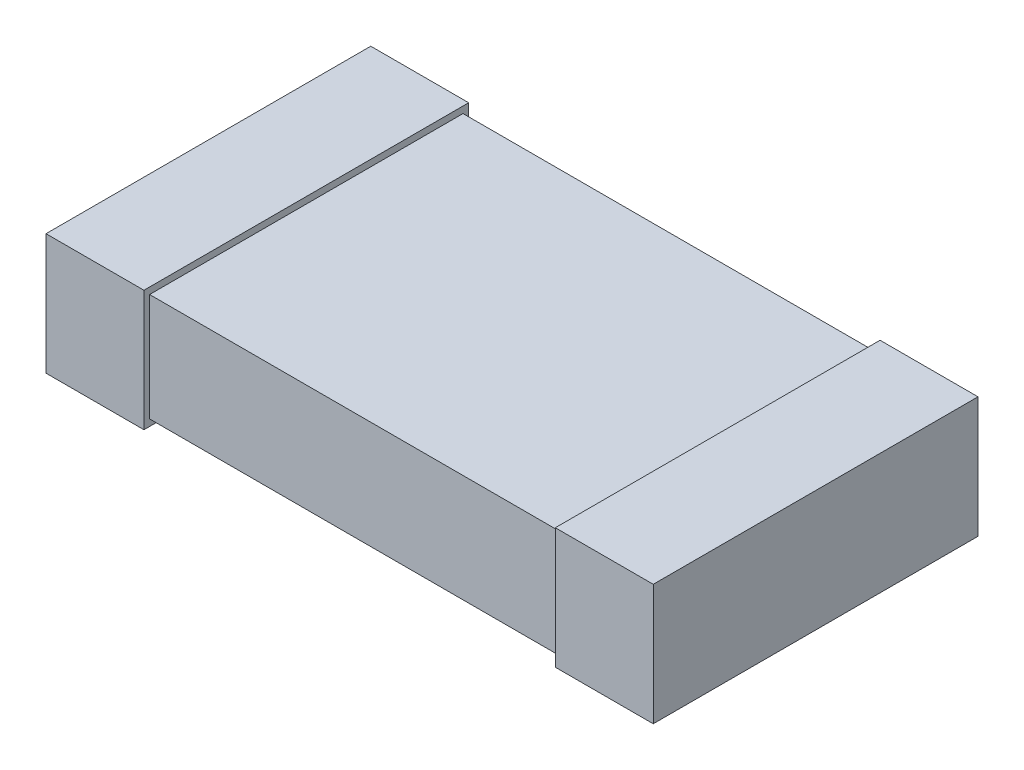
ISO-10303-21;
HEADER;
FILE_DESCRIPTION(('STEP AP214'),'2;1');
FILE_NAME('part.step','',(''),(''),'','','');
FILE_SCHEMA(('AUTOMOTIVE_DESIGN { 1 0 10303 214 1 1 1 1 }'));
ENDSEC;
DATA;
#1=APPLICATION_CONTEXT('core data for automotive mechanical design processes');
#2=APPLICATION_PROTOCOL_DEFINITION('international standard','automotive_design',2000,#1);
#3=PRODUCT_CONTEXT('',#1,'mechanical');
#4=PRODUCT('Part','Part','',(#3));
#5=PRODUCT_RELATED_PRODUCT_CATEGORY('part','',(#4));
#6=PRODUCT_DEFINITION_FORMATION('','',#4);
#7=PRODUCT_DEFINITION_CONTEXT('part definition',#1,'design');
#8=PRODUCT_DEFINITION('design','',#6,#7);
#9=PRODUCT_DEFINITION_SHAPE('','',#8);
#10=(LENGTH_UNIT() NAMED_UNIT(*) SI_UNIT(.MILLI.,.METRE.));
#11=(NAMED_UNIT(*) PLANE_ANGLE_UNIT() SI_UNIT($,.RADIAN.));
#12=(NAMED_UNIT(*) SI_UNIT($,.STERADIAN.) SOLID_ANGLE_UNIT());
#13=UNCERTAINTY_MEASURE_WITH_UNIT(LENGTH_MEASURE(1.E-05),#10,'distance_accuracy_value','');
#14=(GEOMETRIC_REPRESENTATION_CONTEXT(3) GLOBAL_UNCERTAINTY_ASSIGNED_CONTEXT((#13)) GLOBAL_UNIT_ASSIGNED_CONTEXT((#10,
#11,#12)) REPRESENTATION_CONTEXT('',''));
#15=CARTESIAN_POINT('',(0.,0.,0.));
#16=DIRECTION('',(0.,0.,1.));
#17=DIRECTION('',(1.,0.,0.));
#18=AXIS2_PLACEMENT_3D('',#15,#16,#17);
#19=CARTESIAN_POINT('',(-1.55,0.55,-0.8));
#20=DIRECTION('',(1.,0.,0.));
#21=DIRECTION('',(0.,0.,-1.));
#22=AXIS2_PLACEMENT_3D('',#19,#20,#21);
#23=PLANE('',#22);
#24=DIRECTION('',(0.,0.,-1.));
#25=VECTOR('',#24,1.);
#26=CARTESIAN_POINT('',(-1.55,-0.03341828975536,-0.828894255709));
#27=LINE('',#26,#25);
#28=CARTESIAN_POINT('',(-1.55,-0.03341828975536,0.828894255709));
#29=VERTEX_POINT('',#28);
#30=CARTESIAN_POINT('',(-1.55,-0.03341828975536,-0.828894255709));
#31=VERTEX_POINT('',#30);
#32=EDGE_CURVE('E108',#29,#31,#27,.T.);
#33=ORIENTED_EDGE('',*,*,#32,.F.);
#34=DIRECTION('',(0.,1.,0.));
#35=VECTOR('',#34,1.);
#36=CARTESIAN_POINT('',(-1.55,0.583418289755,0.828894255709));
#37=LINE('',#36,#35);
#38=CARTESIAN_POINT('',(-1.55,0.583418289755,0.828894255709));
#39=VERTEX_POINT('',#38);
#40=EDGE_CURVE('E105',#39,#29,#37,.F.);
#41=ORIENTED_EDGE('',*,*,#40,.F.);
#42=DIRECTION('',(0.,0.,1.));
#43=VECTOR('',#42,1.);
#44=CARTESIAN_POINT('',(-1.55,0.583418289755,-0.828894255709));
#45=LINE('',#44,#43);
#46=CARTESIAN_POINT('',(-1.55,0.583418289755,-0.828894255709));
#47=VERTEX_POINT('',#46);
#48=EDGE_CURVE('E121',#47,#39,#45,.T.);
#49=ORIENTED_EDGE('',*,*,#48,.F.);
#50=DIRECTION('',(0.,1.,0.));
#51=VECTOR('',#50,1.);
#52=CARTESIAN_POINT('',(-1.55,0.55,-0.828894255709));
#53=LINE('',#52,#51);
#54=EDGE_CURVE('E20',#31,#47,#53,.T.);
#55=ORIENTED_EDGE('',*,*,#54,.F.);
#56=EDGE_LOOP('',(#33,#41,#49,#55));
#57=FACE_BOUND('',#56,.T.);
#58=ADVANCED_FACE('F17',(#57),#23,.F.);
#59=CARTESIAN_POINT('',(1.55,0.55,-0.8));
#60=DIRECTION('',(-1.,0.,0.));
#61=DIRECTION('',(0.,0.,1.));
#62=AXIS2_PLACEMENT_3D('',#59,#60,#61);
#63=PLANE('',#62);
#64=DIRECTION('',(0.,0.,1.));
#65=VECTOR('',#64,1.);
#66=CARTESIAN_POINT('',(1.55,0.583418289755,0.828894255709));
#67=LINE('',#66,#65);
#68=CARTESIAN_POINT('',(1.55,0.583418289755,0.828894255709));
#69=VERTEX_POINT('',#68);
#70=CARTESIAN_POINT('',(1.55,0.583418289755,-0.828894255709));
#71=VERTEX_POINT('',#70);
#72=EDGE_CURVE('E151',#69,#71,#67,.F.);
#73=ORIENTED_EDGE('',*,*,#72,.F.);
#74=DIRECTION('',(0.,1.,0.));
#75=VECTOR('',#74,1.);
#76=CARTESIAN_POINT('',(1.55,0.583418289755,0.828894255709));
#77=LINE('',#76,#75);
#78=CARTESIAN_POINT('',(1.55,-0.03341828975536,0.828894255709));
#79=VERTEX_POINT('',#78);
#80=EDGE_CURVE('E154',#79,#69,#77,.T.);
#81=ORIENTED_EDGE('',*,*,#80,.F.);
#82=DIRECTION('',(0.,0.,-1.));
#83=VECTOR('',#82,1.);
#84=CARTESIAN_POINT('',(1.55,-0.03341828975536,0.828894255709));
#85=LINE('',#84,#83);
#86=CARTESIAN_POINT('',(1.55,-0.03341828975536,-0.828894255709));
#87=VERTEX_POINT('',#86);
#88=EDGE_CURVE('E160',#87,#79,#85,.F.);
#89=ORIENTED_EDGE('',*,*,#88,.F.);
#90=DIRECTION('',(0.,1.,0.));
#91=VECTOR('',#90,1.);
#92=CARTESIAN_POINT('',(1.55,0.55,-0.828894255709));
#93=LINE('',#92,#91);
#94=EDGE_CURVE('E112',#71,#87,#93,.F.);
#95=ORIENTED_EDGE('',*,*,#94,.F.);
#96=EDGE_LOOP('',(#73,#81,#89,#95));
#97=FACE_BOUND('',#96,.T.);
#98=ADVANCED_FACE('F265',(#97),#63,.F.);
#99=CARTESIAN_POINT('',(-1.05,-0.03341828975536,-0.828894255709));
#100=DIRECTION('',(0.,-1.,0.));
#101=DIRECTION('',(0.,0.,-1.));
#102=AXIS2_PLACEMENT_3D('',#99,#100,#101);
#103=PLANE('',#102);
#104=DIRECTION('',(0.,0.,1.));
#105=VECTOR('',#104,1.);
#106=CARTESIAN_POINT('',(-1.05,-0.03341828975536,0.));
#107=LINE('',#106,#105);
#108=CARTESIAN_POINT('',(-1.05,-0.03341828975536,-0.828894255709));
#109=VERTEX_POINT('',#108);
#110=CARTESIAN_POINT('',(-1.05,-0.03341828975536,0.828894255709));
#111=VERTEX_POINT('',#110);
#112=EDGE_CURVE('E118',#109,#111,#107,.T.);
#113=ORIENTED_EDGE('',*,*,#112,.T.);
#114=DIRECTION('',(1.,0.,0.));
#115=VECTOR('',#114,1.);
#116=CARTESIAN_POINT('',(-1.05,-0.03341828975536,0.828894255709));
#117=LINE('',#116,#115);
#118=EDGE_CURVE('E115',#29,#111,#117,.T.);
#119=ORIENTED_EDGE('',*,*,#118,.F.);
#120=ORIENTED_EDGE('',*,*,#32,.T.);
#121=DIRECTION('',(-1.,0.,0.));
#122=VECTOR('',#121,1.);
#123=CARTESIAN_POINT('',(-1.05,-0.03341828975536,-0.828894255709));
#124=LINE('',#123,#122);
#125=EDGE_CURVE('E140',#109,#31,#124,.T.);
#126=ORIENTED_EDGE('',*,*,#125,.F.);
#127=EDGE_LOOP('',(#113,#119,#120,#126));
#128=FACE_BOUND('',#127,.T.);
#129=ADVANCED_FACE('F116',(#128),#103,.T.);
#130=CARTESIAN_POINT('',(-1.05,0.583418289755,0.828894255709));
#131=DIRECTION('',(0.,0.,1.));
#132=DIRECTION('',(1.,0.,0.));
#133=AXIS2_PLACEMENT_3D('',#130,#131,#132);
#134=PLANE('',#133);
#135=DIRECTION('',(0.,1.,0.));
#136=VECTOR('',#135,1.);
#137=CARTESIAN_POINT('',(-1.05,0.,0.828894255709));
#138=LINE('',#137,#136);
#139=CARTESIAN_POINT('',(-1.05,0.583418289755,0.828894255709));
#140=VERTEX_POINT('',#139);
#141=EDGE_CURVE('E178',#111,#140,#138,.T.);
#142=ORIENTED_EDGE('',*,*,#141,.T.);
#143=DIRECTION('',(1.,0.,0.));
#144=VECTOR('',#143,1.);
#145=CARTESIAN_POINT('',(-1.05,0.583418289755,0.828894255709));
#146=LINE('',#145,#144);
#147=EDGE_CURVE('E125',#39,#140,#146,.T.);
#148=ORIENTED_EDGE('',*,*,#147,.F.);
#149=ORIENTED_EDGE('',*,*,#40,.T.);
#150=ORIENTED_EDGE('',*,*,#118,.T.);
#151=EDGE_LOOP('',(#142,#148,#149,#150));
#152=FACE_BOUND('',#151,.T.);
#153=ADVANCED_FACE('F123',(#152),#134,.T.);
#154=CARTESIAN_POINT('',(-1.05,0.583418289755,-0.828894255709));
#155=DIRECTION('',(0.,1.,0.));
#156=DIRECTION('',(0.,0.,1.));
#157=AXIS2_PLACEMENT_3D('',#154,#155,#156);
#158=PLANE('',#157);
#159=DIRECTION('',(0.,0.,1.));
#160=VECTOR('',#159,1.);
#161=CARTESIAN_POINT('',(-1.05,0.583418289755,0.));
#162=LINE('',#161,#160);
#163=CARTESIAN_POINT('',(-1.05,0.583418289755,-0.828894255709));
#164=VERTEX_POINT('',#163);
#165=EDGE_CURVE('E144',#140,#164,#162,.F.);
#166=ORIENTED_EDGE('',*,*,#165,.T.);
#167=DIRECTION('',(-1.,0.,0.));
#168=VECTOR('',#167,1.);
#169=CARTESIAN_POINT('',(-1.05,0.583418289755,-0.828894255709));
#170=LINE('',#169,#168);
#171=EDGE_CURVE('E138',#47,#164,#170,.F.);
#172=ORIENTED_EDGE('',*,*,#171,.F.);
#173=ORIENTED_EDGE('',*,*,#48,.T.);
#174=ORIENTED_EDGE('',*,*,#147,.T.);
#175=EDGE_LOOP('',(#166,#172,#173,#174));
#176=FACE_BOUND('',#175,.T.);
#177=ADVANCED_FACE('F142',(#176),#158,.T.);
#178=CARTESIAN_POINT('',(-1.05,0.583418289755,-0.828894255709));
#179=DIRECTION('',(0.,0.,-1.));
#180=DIRECTION('',(-1.,0.,0.));
#181=AXIS2_PLACEMENT_3D('',#178,#179,#180);
#182=PLANE('',#181);
#183=DIRECTION('',(0.,1.,0.));
#184=VECTOR('',#183,1.);
#185=CARTESIAN_POINT('',(-1.05,0.,-0.828894255709));
#186=LINE('',#185,#184);
#187=EDGE_CURVE('E181',#164,#109,#186,.F.);
#188=ORIENTED_EDGE('',*,*,#187,.T.);
#189=ORIENTED_EDGE('',*,*,#125,.T.);
#190=ORIENTED_EDGE('',*,*,#54,.T.);
#191=ORIENTED_EDGE('',*,*,#171,.T.);
#192=EDGE_LOOP('',(#188,#189,#190,#191));
#193=FACE_BOUND('',#192,.T.);
#194=ADVANCED_FACE('F136',(#193),#182,.T.);
#195=CARTESIAN_POINT('',(0.,0.,0.));
#196=DIRECTION('',(0.,1.,0.));
#197=DIRECTION('',(0.,0.,1.));
#198=AXIS2_PLACEMENT_3D('',#195,#196,#197);
#199=PLANE('',#198);
#200=DIRECTION('',(1.,0.,0.));
#201=VECTOR('',#200,1.);
#202=CARTESIAN_POINT('',(-1.55,0.,-0.8));
#203=LINE('',#202,#201);
#204=CARTESIAN_POINT('',(-1.05,0.,-0.8));
#205=VERTEX_POINT('',#204);
#206=CARTESIAN_POINT('',(1.05,0.,-0.8));
#207=VERTEX_POINT('',#206);
#208=EDGE_CURVE('E170',#205,#207,#203,.T.);
#209=ORIENTED_EDGE('',*,*,#208,.T.);
#210=DIRECTION('',(0.,0.,1.));
#211=VECTOR('',#210,1.);
#212=CARTESIAN_POINT('',(1.05,0.,0.));
#213=LINE('',#212,#211);
#214=CARTESIAN_POINT('',(1.05,0.,0.8));
#215=VERTEX_POINT('',#214);
#216=EDGE_CURVE('E146',#215,#207,#213,.F.);
#217=ORIENTED_EDGE('',*,*,#216,.F.);
#218=DIRECTION('',(-1.,0.,0.));
#219=VECTOR('',#218,1.);
#220=CARTESIAN_POINT('',(-1.55,0.,0.8));
#221=LINE('',#220,#219);
#222=CARTESIAN_POINT('',(-1.05,0.,0.8));
#223=VERTEX_POINT('',#222);
#224=EDGE_CURVE('E183',#215,#223,#221,.T.);
#225=ORIENTED_EDGE('',*,*,#224,.T.);
#226=DIRECTION('',(0.,0.,1.));
#227=VECTOR('',#226,1.);
#228=CARTESIAN_POINT('',(-1.05,0.,0.));
#229=LINE('',#228,#227);
#230=EDGE_CURVE('E173',#223,#205,#229,.F.);
#231=ORIENTED_EDGE('',*,*,#230,.T.);
#232=EDGE_LOOP('',(#209,#217,#225,#231));
#233=FACE_BOUND('',#232,.T.);
#234=ADVANCED_FACE('F218',(#233),#199,.F.);
#235=CARTESIAN_POINT('',(1.05,0.583418289755,0.828894255709));
#236=DIRECTION('',(0.,1.,0.));
#237=DIRECTION('',(0.,0.,1.));
#238=AXIS2_PLACEMENT_3D('',#235,#236,#237);
#239=PLANE('',#238);
#240=DIRECTION('',(0.,0.,-1.));
#241=VECTOR('',#240,1.);
#242=CARTESIAN_POINT('',(1.05,0.583418289755,0.));
#243=LINE('',#242,#241);
#244=CARTESIAN_POINT('',(1.05,0.583418289755,-0.828894255709));
#245=VERTEX_POINT('',#244);
#246=CARTESIAN_POINT('',(1.05,0.583418289755,0.828894255709));
#247=VERTEX_POINT('',#246);
#248=EDGE_CURVE('E191',#245,#247,#243,.F.);
#249=ORIENTED_EDGE('',*,*,#248,.T.);
#250=DIRECTION('',(1.,0.,0.));
#251=VECTOR('',#250,1.);
#252=CARTESIAN_POINT('',(1.05,0.583418289755,0.828894255709));
#253=LINE('',#252,#251);
#254=EDGE_CURVE('E157',#69,#247,#253,.F.);
#255=ORIENTED_EDGE('',*,*,#254,.F.);
#256=ORIENTED_EDGE('',*,*,#72,.T.);
#257=DIRECTION('',(-1.,0.,0.));
#258=VECTOR('',#257,1.);
#259=CARTESIAN_POINT('',(1.05,0.583418289755,-0.828894255709));
#260=LINE('',#259,#258);
#261=EDGE_CURVE('E168',#245,#71,#260,.F.);
#262=ORIENTED_EDGE('',*,*,#261,.F.);
#263=EDGE_LOOP('',(#249,#255,#256,#262));
#264=FACE_BOUND('',#263,.T.);
#265=ADVANCED_FACE('F251',(#264),#239,.T.);
#266=CARTESIAN_POINT('',(1.05,0.583418289755,0.828894255709));
#267=DIRECTION('',(0.,0.,1.));
#268=DIRECTION('',(1.,0.,0.));
#269=AXIS2_PLACEMENT_3D('',#266,#267,#268);
#270=PLANE('',#269);
#271=DIRECTION('',(0.,1.,0.));
#272=VECTOR('',#271,1.);
#273=CARTESIAN_POINT('',(1.05,0.,0.828894255709));
#274=LINE('',#273,#272);
#275=CARTESIAN_POINT('',(1.05,-0.03341828975536,0.828894255709));
#276=VERTEX_POINT('',#275);
#277=EDGE_CURVE('E193',#247,#276,#274,.F.);
#278=ORIENTED_EDGE('',*,*,#277,.T.);
#279=DIRECTION('',(1.,0.,0.));
#280=VECTOR('',#279,1.);
#281=CARTESIAN_POINT('',(1.05,-0.03341828975536,0.828894255709));
#282=LINE('',#281,#280);
#283=EDGE_CURVE('E163',#79,#276,#282,.F.);
#284=ORIENTED_EDGE('',*,*,#283,.F.);
#285=ORIENTED_EDGE('',*,*,#80,.T.);
#286=ORIENTED_EDGE('',*,*,#254,.T.);
#287=EDGE_LOOP('',(#278,#284,#285,#286));
#288=FACE_BOUND('',#287,.T.);
#289=ADVANCED_FACE('F247',(#288),#270,.T.);
#290=CARTESIAN_POINT('',(1.05,-0.03341828975536,0.828894255709));
#291=DIRECTION('',(0.,-1.,0.));
#292=DIRECTION('',(0.,0.,-1.));
#293=AXIS2_PLACEMENT_3D('',#290,#291,#292);
#294=PLANE('',#293);
#295=DIRECTION('',(0.,0.,-1.));
#296=VECTOR('',#295,1.);
#297=CARTESIAN_POINT('',(1.05,-0.03341828975536,0.));
#298=LINE('',#297,#296);
#299=CARTESIAN_POINT('',(1.05,-0.03341828975536,-0.828894255709));
#300=VERTEX_POINT('',#299);
#301=EDGE_CURVE('E195',#276,#300,#298,.T.);
#302=ORIENTED_EDGE('',*,*,#301,.T.);
#303=DIRECTION('',(-1.,0.,0.));
#304=VECTOR('',#303,1.);
#305=CARTESIAN_POINT('',(1.05,-0.03341828975536,-0.828894255709));
#306=LINE('',#305,#304);
#307=EDGE_CURVE('E166',#87,#300,#306,.T.);
#308=ORIENTED_EDGE('',*,*,#307,.F.);
#309=ORIENTED_EDGE('',*,*,#88,.T.);
#310=ORIENTED_EDGE('',*,*,#283,.T.);
#311=EDGE_LOOP('',(#302,#308,#309,#310));
#312=FACE_BOUND('',#311,.T.);
#313=ADVANCED_FACE('F244',(#312),#294,.T.);
#314=CARTESIAN_POINT('',(1.05,0.583418289755,-0.828894255709));
#315=DIRECTION('',(0.,0.,-1.));
#316=DIRECTION('',(-1.,0.,0.));
#317=AXIS2_PLACEMENT_3D('',#314,#315,#316);
#318=PLANE('',#317);
#319=DIRECTION('',(0.,1.,0.));
#320=VECTOR('',#319,1.);
#321=CARTESIAN_POINT('',(1.05,0.,-0.828894255709));
#322=LINE('',#321,#320);
#323=EDGE_CURVE('E197',#300,#245,#322,.T.);
#324=ORIENTED_EDGE('',*,*,#323,.T.);
#325=ORIENTED_EDGE('',*,*,#261,.T.);
#326=ORIENTED_EDGE('',*,*,#94,.T.);
#327=ORIENTED_EDGE('',*,*,#307,.T.);
#328=EDGE_LOOP('',(#324,#325,#326,#327));
#329=FACE_BOUND('',#328,.T.);
#330=ADVANCED_FACE('F241',(#329),#318,.T.);
#331=CARTESIAN_POINT('',(-1.55,0.55,-0.8));
#332=DIRECTION('',(0.,0.,1.));
#333=DIRECTION('',(1.,0.,0.));
#334=AXIS2_PLACEMENT_3D('',#331,#332,#333);
#335=PLANE('',#334);
#336=DIRECTION('',(1.,0.,0.));
#337=VECTOR('',#336,1.);
#338=CARTESIAN_POINT('',(0.,0.55,-0.8));
#339=LINE('',#338,#337);
#340=CARTESIAN_POINT('',(1.05,0.55,-0.8));
#341=VERTEX_POINT('',#340);
#342=CARTESIAN_POINT('',(-1.05,0.55,-0.8));
#343=VERTEX_POINT('',#342);
#344=EDGE_CURVE('E200',#341,#343,#339,.F.);
#345=ORIENTED_EDGE('',*,*,#344,.F.);
#346=DIRECTION('',(0.,1.,0.));
#347=VECTOR('',#346,1.);
#348=CARTESIAN_POINT('',(1.05,0.,-0.8));
#349=LINE('',#348,#347);
#350=EDGE_CURVE('E187',#341,#207,#349,.F.);
#351=ORIENTED_EDGE('',*,*,#350,.T.);
#352=ORIENTED_EDGE('',*,*,#208,.F.);
#353=DIRECTION('',(0.,1.,0.));
#354=VECTOR('',#353,1.);
#355=CARTESIAN_POINT('',(-1.05,0.,-0.8));
#356=LINE('',#355,#354);
#357=EDGE_CURVE('E175',#205,#343,#356,.T.);
#358=ORIENTED_EDGE('',*,*,#357,.T.);
#359=EDGE_LOOP('',(#345,#351,#352,#358));
#360=FACE_BOUND('',#359,.T.);
#361=ADVANCED_FACE('F220',(#360),#335,.F.);
#362=CARTESIAN_POINT('',(-1.05,0.,0.));
#363=DIRECTION('',(-1.,0.,0.));
#364=DIRECTION('',(0.,0.,1.));
#365=AXIS2_PLACEMENT_3D('',#362,#363,#364);
#366=PLANE('',#365);
#367=ORIENTED_EDGE('',*,*,#165,.F.);
#368=ORIENTED_EDGE('',*,*,#141,.F.);
#369=ORIENTED_EDGE('',*,*,#112,.F.);
#370=ORIENTED_EDGE('',*,*,#187,.F.);
#371=EDGE_LOOP('',(#367,#368,#369,#370));
#372=FACE_BOUND('',#371,.T.);
#373=ORIENTED_EDGE('',*,*,#357,.F.);
#374=ORIENTED_EDGE('',*,*,#230,.F.);
#375=DIRECTION('',(0.,1.,0.));
#376=VECTOR('',#375,1.);
#377=CARTESIAN_POINT('',(-1.05,0.55,0.8));
#378=LINE('',#377,#376);
#379=CARTESIAN_POINT('',(-1.05,0.55,0.8));
#380=VERTEX_POINT('',#379);
#381=EDGE_CURVE('E185',#223,#380,#378,.T.);
#382=ORIENTED_EDGE('',*,*,#381,.T.);
#383=DIRECTION('',(0.,0.,1.));
#384=VECTOR('',#383,1.);
#385=CARTESIAN_POINT('',(-1.05,0.55,0.));
#386=LINE('',#385,#384);
#387=EDGE_CURVE('E203',#343,#380,#386,.T.);
#388=ORIENTED_EDGE('',*,*,#387,.F.);
#389=EDGE_LOOP('',(#373,#374,#382,#388));
#390=FACE_BOUND('',#389,.T.);
#391=ADVANCED_FACE('F215',(#372,#390),#366,.F.);
#392=CARTESIAN_POINT('',(-1.55,0.55,0.8));
#393=DIRECTION('',(0.,0.,-1.));
#394=DIRECTION('',(-1.,0.,0.));
#395=AXIS2_PLACEMENT_3D('',#392,#393,#394);
#396=PLANE('',#395);
#397=ORIENTED_EDGE('',*,*,#224,.F.);
#398=DIRECTION('',(0.,1.,0.));
#399=VECTOR('',#398,1.);
#400=CARTESIAN_POINT('',(1.05,0.,0.8));
#401=LINE('',#400,#399);
#402=CARTESIAN_POINT('',(1.05,0.55,0.8));
#403=VERTEX_POINT('',#402);
#404=EDGE_CURVE('E35',#215,#403,#401,.T.);
#405=ORIENTED_EDGE('',*,*,#404,.T.);
#406=DIRECTION('',(1.,0.,0.));
#407=VECTOR('',#406,1.);
#408=CARTESIAN_POINT('',(0.,0.55,0.8));
#409=LINE('',#408,#407);
#410=EDGE_CURVE('E26',#380,#403,#409,.T.);
#411=ORIENTED_EDGE('',*,*,#410,.F.);
#412=ORIENTED_EDGE('',*,*,#381,.F.);
#413=EDGE_LOOP('',(#397,#405,#411,#412));
#414=FACE_BOUND('',#413,.T.);
#415=ADVANCED_FACE('F211',(#414),#396,.F.);
#416=CARTESIAN_POINT('',(1.05,0.,0.));
#417=DIRECTION('',(1.,0.,0.));
#418=DIRECTION('',(0.,0.,-1.));
#419=AXIS2_PLACEMENT_3D('',#416,#417,#418);
#420=PLANE('',#419);
#421=ORIENTED_EDGE('',*,*,#301,.F.);
#422=ORIENTED_EDGE('',*,*,#277,.F.);
#423=ORIENTED_EDGE('',*,*,#248,.F.);
#424=ORIENTED_EDGE('',*,*,#323,.F.);
#425=EDGE_LOOP('',(#421,#422,#423,#424));
#426=FACE_BOUND('',#425,.T.);
#427=ORIENTED_EDGE('',*,*,#404,.F.);
#428=ORIENTED_EDGE('',*,*,#216,.T.);
#429=ORIENTED_EDGE('',*,*,#350,.F.);
#430=DIRECTION('',(0.,0.,1.));
#431=VECTOR('',#430,1.);
#432=CARTESIAN_POINT('',(1.05,0.55,0.));
#433=LINE('',#432,#431);
#434=EDGE_CURVE('E11',#403,#341,#433,.F.);
#435=ORIENTED_EDGE('',*,*,#434,.F.);
#436=EDGE_LOOP('',(#427,#428,#429,#435));
#437=FACE_BOUND('',#436,.T.);
#438=ADVANCED_FACE('F223',(#426,#437),#420,.F.);
#439=CARTESIAN_POINT('',(0.,0.55,0.));
#440=DIRECTION('',(0.,1.,0.));
#441=DIRECTION('',(0.,0.,1.));
#442=AXIS2_PLACEMENT_3D('',#439,#440,#441);
#443=PLANE('',#442);
#444=ORIENTED_EDGE('',*,*,#410,.T.);
#445=ORIENTED_EDGE('',*,*,#434,.T.);
#446=ORIENTED_EDGE('',*,*,#344,.T.);
#447=ORIENTED_EDGE('',*,*,#387,.T.);
#448=EDGE_LOOP('',(#444,#445,#446,#447));
#449=FACE_BOUND('',#448,.T.);
#450=ADVANCED_FACE('F208',(#449),#443,.T.);
#451=CLOSED_SHELL('',(#58,#98,#129,#153,#177,#194,#234,#265,#289,#313,#330,#361,#391,#415,#438,#450));
#452=MANIFOLD_SOLID_BREP('B1',#451);
#453=ADVANCED_BREP_SHAPE_REPRESENTATION('',(#18,#452),#14);
#454=SHAPE_DEFINITION_REPRESENTATION(#9,#453);
ENDSEC;
END-ISO-10303-21;
